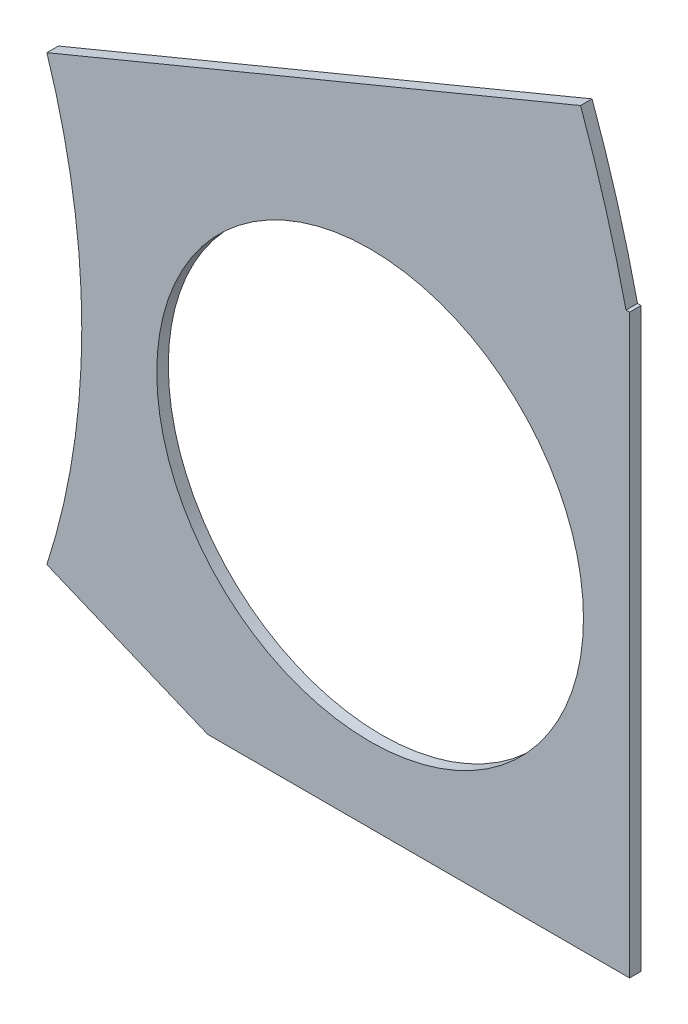
ISO-10303-21;
HEADER;
FILE_DESCRIPTION(('STEP AP214'),'2;1');
FILE_NAME('part.step','',(''),(''),'','','');
FILE_SCHEMA(('AUTOMOTIVE_DESIGN { 1 0 10303 214 1 1 1 1 }'));
ENDSEC;
DATA;
#1=APPLICATION_CONTEXT('core data for automotive mechanical design processes');
#2=APPLICATION_PROTOCOL_DEFINITION('international standard','automotive_design',2000,#1);
#3=PRODUCT_CONTEXT('',#1,'mechanical');
#4=PRODUCT('Part','Part','',(#3));
#5=PRODUCT_RELATED_PRODUCT_CATEGORY('part','',(#4));
#6=PRODUCT_DEFINITION_FORMATION('','',#4);
#7=PRODUCT_DEFINITION_CONTEXT('part definition',#1,'design');
#8=PRODUCT_DEFINITION('design','',#6,#7);
#9=PRODUCT_DEFINITION_SHAPE('','',#8);
#10=(LENGTH_UNIT() NAMED_UNIT(*) SI_UNIT(.MILLI.,.METRE.));
#11=(NAMED_UNIT(*) PLANE_ANGLE_UNIT() SI_UNIT($,.RADIAN.));
#12=(NAMED_UNIT(*) SI_UNIT($,.STERADIAN.) SOLID_ANGLE_UNIT());
#13=UNCERTAINTY_MEASURE_WITH_UNIT(LENGTH_MEASURE(1.E-05),#10,'distance_accuracy_value','');
#14=(GEOMETRIC_REPRESENTATION_CONTEXT(3) GLOBAL_UNCERTAINTY_ASSIGNED_CONTEXT((#13)) GLOBAL_UNIT_ASSIGNED_CONTEXT((#10,
#11,#12)) REPRESENTATION_CONTEXT('',''));
#15=CARTESIAN_POINT('',(0.,0.,0.));
#16=DIRECTION('',(0.,0.,1.));
#17=DIRECTION('',(1.,0.,0.));
#18=AXIS2_PLACEMENT_3D('',#15,#16,#17);
#19=CARTESIAN_POINT('',(0.,0.,0.254));
#20=DIRECTION('',(0.,0.,-1.));
#21=DIRECTION('',(-1.,0.,0.));
#22=AXIS2_PLACEMENT_3D('',#19,#20,#21);
#23=PLANE('',#22);
#24=CARTESIAN_POINT('',(22.225,0.,0.254));
#25=DIRECTION('',(0.,0.,1.));
#26=DIRECTION('',(1.,0.,0.));
#27=AXIS2_PLACEMENT_3D('',#24,#25,#26);
#28=CIRCLE('',#27,4.699);
#29=CARTESIAN_POINT('',(26.924,0.,0.254));
#30=VERTEX_POINT('',#29);
#31=EDGE_CURVE('E117',#30,#30,#28,.T.);
#32=ORIENTED_EDGE('',*,*,#31,.F.);
#33=EDGE_LOOP('',(#32));
#34=FACE_BOUND('',#33,.T.);
#35=CARTESIAN_POINT('',(0.,0.,0.254));
#36=DIRECTION('',(0.,0.,-1.));
#37=DIRECTION('',(-1.,0.,0.));
#38=AXIS2_PLACEMENT_3D('',#35,#36,#37);
#39=CIRCLE('',#38,28.575);
#40=CARTESIAN_POINT('',(26.8597787783913,9.75104655797939,0.254));
#41=VERTEX_POINT('',#40);
#42=CARTESIAN_POINT('',(27.86051192997,6.34999999999999,0.254));
#43=VERTEX_POINT('',#42);
#44=EDGE_CURVE('E108',#41,#43,#39,.T.);
#45=ORIENTED_EDGE('',*,*,#44,.F.);
#46=DIRECTION('',(0.923879532511287,0.38268343236509,0.));
#47=VECTOR('',#46,1.);
#48=CARTESIAN_POINT('',(14.5659320345757,4.65876850295464,0.254));
#49=LINE('',#48,#47);
#50=CARTESIAN_POINT('',(15.1055871232775,4.88230095969858,0.254));
#51=VERTEX_POINT('',#50);
#52=EDGE_CURVE('E128',#51,#41,#49,.T.);
#53=ORIENTED_EDGE('',*,*,#52,.F.);
#54=CARTESIAN_POINT('',(0.,0.,0.254));
#55=DIRECTION('',(0.,0.,-1.));
#56=DIRECTION('',(-1.,0.,0.));
#57=AXIS2_PLACEMENT_3D('',#54,#55,#56);
#58=CIRCLE('',#57,15.875);
#59=CARTESIAN_POINT('',(15.1055871232775,-4.88230095969859,0.254));
#60=VERTEX_POINT('',#59);
#61=EDGE_CURVE('E95',#51,#60,#58,.T.);
#62=ORIENTED_EDGE('',*,*,#61,.T.);
#63=DIRECTION('',(0.923879532511287,-0.38268343236509,0.));
#64=VECTOR('',#63,1.);
#65=CARTESIAN_POINT('',(15.1055871232775,-4.88230095969859,0.254));
#66=LINE('',#65,#64);
#67=CARTESIAN_POINT('',(18.6489260518551,-6.35000000000001,0.254));
#68=VERTEX_POINT('',#67);
#69=EDGE_CURVE('E58',#60,#68,#66,.T.);
#70=ORIENTED_EDGE('',*,*,#69,.T.);
#71=DIRECTION('',(1.,0.,0.));
#72=VECTOR('',#71,1.);
#73=CARTESIAN_POINT('',(101.401368333963,-6.35,0.254));
#74=LINE('',#73,#72);
#75=CARTESIAN_POINT('',(27.94,-6.35000000000001,0.254));
#76=VERTEX_POINT('',#75);
#77=EDGE_CURVE('E88',#68,#76,#74,.T.);
#78=ORIENTED_EDGE('',*,*,#77,.T.);
#79=DIRECTION('',(0.,-1.,0.));
#80=VECTOR('',#79,1.);
#81=CARTESIAN_POINT('',(27.94,-6.35000000000001,0.254));
#82=LINE('',#81,#80);
#83=CARTESIAN_POINT('',(27.94,6.34999999999999,0.254));
#84=VERTEX_POINT('',#83);
#85=EDGE_CURVE('E124',#84,#76,#82,.T.);
#86=ORIENTED_EDGE('',*,*,#85,.F.);
#87=DIRECTION('',(1.,0.,0.));
#88=VECTOR('',#87,1.);
#89=CARTESIAN_POINT('',(88.6729242779328,6.35,0.254));
#90=LINE('',#89,#88);
#91=EDGE_CURVE('E105',#43,#84,#90,.T.);
#92=ORIENTED_EDGE('',*,*,#91,.F.);
#93=EDGE_LOOP('',(#45,#53,#62,#70,#78,#86,#92));
#94=FACE_BOUND('',#93,.T.);
#95=ADVANCED_FACE('F35',(#34,#94),#23,.F.);
#96=CARTESIAN_POINT('',(0.,0.,0.));
#97=DIRECTION('',(0.,0.,-1.));
#98=DIRECTION('',(-1.,0.,0.));
#99=AXIS2_PLACEMENT_3D('',#96,#97,#98);
#100=PLANE('',#99);
#101=CARTESIAN_POINT('',(22.225,0.,0.));
#102=DIRECTION('',(0.,0.,1.));
#103=DIRECTION('',(1.,0.,0.));
#104=AXIS2_PLACEMENT_3D('',#101,#102,#103);
#105=CIRCLE('',#104,4.699);
#106=CARTESIAN_POINT('',(26.924,0.,0.));
#107=VERTEX_POINT('',#106);
#108=EDGE_CURVE('E112',#107,#107,#105,.T.);
#109=ORIENTED_EDGE('',*,*,#108,.T.);
#110=EDGE_LOOP('',(#109));
#111=FACE_BOUND('',#110,.T.);
#112=DIRECTION('',(0.923879532511287,0.38268343236509,0.));
#113=VECTOR('',#112,1.);
#114=CARTESIAN_POINT('',(14.5659320345757,4.65876850295464,0.));
#115=LINE('',#114,#113);
#116=CARTESIAN_POINT('',(15.1055871232775,4.88230095969858,0.));
#117=VERTEX_POINT('',#116);
#118=CARTESIAN_POINT('',(26.8597787783913,9.75104655797939,0.));
#119=VERTEX_POINT('',#118);
#120=EDGE_CURVE('E50',#117,#119,#115,.T.);
#121=ORIENTED_EDGE('',*,*,#120,.T.);
#122=CARTESIAN_POINT('',(0.,0.,0.));
#123=DIRECTION('',(0.,0.,-1.));
#124=DIRECTION('',(-1.,0.,0.));
#125=AXIS2_PLACEMENT_3D('',#122,#123,#124);
#126=CIRCLE('',#125,28.575);
#127=CARTESIAN_POINT('',(27.86051192997,6.34999999999999,0.));
#128=VERTEX_POINT('',#127);
#129=EDGE_CURVE('E109',#119,#128,#126,.T.);
#130=ORIENTED_EDGE('',*,*,#129,.T.);
#131=DIRECTION('',(1.,0.,0.));
#132=VECTOR('',#131,1.);
#133=CARTESIAN_POINT('',(88.6729242779328,6.35,0.));
#134=LINE('',#133,#132);
#135=CARTESIAN_POINT('',(27.94,6.34999999999999,0.));
#136=VERTEX_POINT('',#135);
#137=EDGE_CURVE('E106',#128,#136,#134,.T.);
#138=ORIENTED_EDGE('',*,*,#137,.T.);
#139=DIRECTION('',(0.,-1.,0.));
#140=VECTOR('',#139,1.);
#141=CARTESIAN_POINT('',(27.94,-6.35000000000001,0.));
#142=LINE('',#141,#140);
#143=CARTESIAN_POINT('',(27.94,-6.35000000000001,0.));
#144=VERTEX_POINT('',#143);
#145=EDGE_CURVE('E94',#136,#144,#142,.T.);
#146=ORIENTED_EDGE('',*,*,#145,.T.);
#147=DIRECTION('',(1.,0.,0.));
#148=VECTOR('',#147,1.);
#149=CARTESIAN_POINT('',(101.401368333963,-6.35,0.));
#150=LINE('',#149,#148);
#151=CARTESIAN_POINT('',(18.6489260518551,-6.35000000000001,0.));
#152=VERTEX_POINT('',#151);
#153=EDGE_CURVE('E80',#152,#144,#150,.T.);
#154=ORIENTED_EDGE('',*,*,#153,.F.);
#155=DIRECTION('',(0.923879532511287,-0.38268343236509,0.));
#156=VECTOR('',#155,1.);
#157=CARTESIAN_POINT('',(15.1055871232775,-4.88230095969859,0.));
#158=LINE('',#157,#156);
#159=CARTESIAN_POINT('',(15.1055871232775,-4.88230095969859,0.));
#160=VERTEX_POINT('',#159);
#161=EDGE_CURVE('E71',#160,#152,#158,.T.);
#162=ORIENTED_EDGE('',*,*,#161,.F.);
#163=CARTESIAN_POINT('',(0.,0.,0.));
#164=DIRECTION('',(0.,0.,-1.));
#165=DIRECTION('',(-1.,0.,0.));
#166=AXIS2_PLACEMENT_3D('',#163,#164,#165);
#167=CIRCLE('',#166,15.875);
#168=EDGE_CURVE('E81',#117,#160,#167,.T.);
#169=ORIENTED_EDGE('',*,*,#168,.F.);
#170=EDGE_LOOP('',(#121,#130,#138,#146,#154,#162,#169));
#171=FACE_BOUND('',#170,.T.);
#172=ADVANCED_FACE('F91',(#111,#171),#100,.T.);
#173=CARTESIAN_POINT('',(0.,0.,0.254));
#174=DIRECTION('',(0.,0.,-1.));
#175=DIRECTION('',(-1.,0.,0.));
#176=AXIS2_PLACEMENT_3D('',#173,#174,#175);
#177=CYLINDRICAL_SURFACE('',#176,28.575);
#178=ORIENTED_EDGE('',*,*,#129,.F.);
#179=DIRECTION('',(0.,0.,-1.));
#180=VECTOR('',#179,1.);
#181=CARTESIAN_POINT('',(26.8597787783913,9.75104655797939,0.254));
#182=LINE('',#181,#180);
#183=EDGE_CURVE('E135',#119,#41,#182,.F.);
#184=ORIENTED_EDGE('',*,*,#183,.T.);
#185=ORIENTED_EDGE('',*,*,#44,.T.);
#186=DIRECTION('',(0.,0.,-1.));
#187=VECTOR('',#186,1.);
#188=CARTESIAN_POINT('',(27.86051192997,6.34999999999999,0.254));
#189=LINE('',#188,#187);
#190=EDGE_CURVE('E100',#43,#128,#189,.T.);
#191=ORIENTED_EDGE('',*,*,#190,.T.);
#192=EDGE_LOOP('',(#178,#184,#185,#191));
#193=FACE_BOUND('',#192,.T.);
#194=ADVANCED_FACE('F141',(#193),#177,.T.);
#195=CARTESIAN_POINT('',(88.6729242779328,6.35,0.254));
#196=DIRECTION('',(0.,1.,0.));
#197=DIRECTION('',(-1.,0.,0.));
#198=AXIS2_PLACEMENT_3D('',#195,#196,#197);
#199=PLANE('',#198);
#200=ORIENTED_EDGE('',*,*,#91,.T.);
#201=DIRECTION('',(0.,0.,-1.));
#202=VECTOR('',#201,1.);
#203=CARTESIAN_POINT('',(27.94,6.34999999999999,0.254));
#204=LINE('',#203,#202);
#205=EDGE_CURVE('E131',#84,#136,#204,.T.);
#206=ORIENTED_EDGE('',*,*,#205,.T.);
#207=ORIENTED_EDGE('',*,*,#137,.F.);
#208=ORIENTED_EDGE('',*,*,#190,.F.);
#209=EDGE_LOOP('',(#200,#206,#207,#208));
#210=FACE_BOUND('',#209,.T.);
#211=ADVANCED_FACE('F155',(#210),#199,.T.);
#212=CARTESIAN_POINT('',(101.401368333963,-6.35,0.254));
#213=DIRECTION('',(0.,1.,0.));
#214=DIRECTION('',(-1.,0.,0.));
#215=AXIS2_PLACEMENT_3D('',#212,#213,#214);
#216=PLANE('',#215);
#217=ORIENTED_EDGE('',*,*,#153,.T.);
#218=DIRECTION('',(0.,0.,1.));
#219=VECTOR('',#218,1.);
#220=CARTESIAN_POINT('',(27.94,-6.35000000000001,0.));
#221=LINE('',#220,#219);
#222=EDGE_CURVE('E120',#144,#76,#221,.T.);
#223=ORIENTED_EDGE('',*,*,#222,.T.);
#224=ORIENTED_EDGE('',*,*,#77,.F.);
#225=DIRECTION('',(0.,0.,-1.));
#226=VECTOR('',#225,1.);
#227=CARTESIAN_POINT('',(18.6489260518551,-6.35000000000001,0.254));
#228=LINE('',#227,#226);
#229=EDGE_CURVE('E74',#68,#152,#228,.T.);
#230=ORIENTED_EDGE('',*,*,#229,.T.);
#231=EDGE_LOOP('',(#217,#223,#224,#230));
#232=FACE_BOUND('',#231,.T.);
#233=ADVANCED_FACE('F85',(#232),#216,.F.);
#234=CARTESIAN_POINT('',(0.,0.,0.254));
#235=DIRECTION('',(0.,0.,-1.));
#236=DIRECTION('',(-1.,0.,0.));
#237=AXIS2_PLACEMENT_3D('',#234,#235,#236);
#238=CYLINDRICAL_SURFACE('',#237,15.875);
#239=ORIENTED_EDGE('',*,*,#61,.F.);
#240=DIRECTION('',(0.,0.,-1.));
#241=VECTOR('',#240,1.);
#242=CARTESIAN_POINT('',(15.1055871232775,4.88230095969859,0.254));
#243=LINE('',#242,#241);
#244=EDGE_CURVE('E12',#51,#117,#243,.T.);
#245=ORIENTED_EDGE('',*,*,#244,.T.);
#246=ORIENTED_EDGE('',*,*,#168,.T.);
#247=DIRECTION('',(0.,0.,-1.));
#248=VECTOR('',#247,1.);
#249=CARTESIAN_POINT('',(15.1055871232775,-4.88230095969859,0.254));
#250=LINE('',#249,#248);
#251=EDGE_CURVE('E43',#60,#160,#250,.T.);
#252=ORIENTED_EDGE('',*,*,#251,.F.);
#253=EDGE_LOOP('',(#239,#245,#246,#252));
#254=FACE_BOUND('',#253,.T.);
#255=ADVANCED_FACE('F37',(#254),#238,.F.);
#256=CARTESIAN_POINT('',(15.1055871232775,-4.88230095969859,0.254));
#257=DIRECTION('',(0.38268343236509,0.923879532511287,0.));
#258=DIRECTION('',(-0.923879532511287,0.38268343236509,0.));
#259=AXIS2_PLACEMENT_3D('',#256,#257,#258);
#260=PLANE('',#259);
#261=ORIENTED_EDGE('',*,*,#161,.T.);
#262=ORIENTED_EDGE('',*,*,#229,.F.);
#263=ORIENTED_EDGE('',*,*,#69,.F.);
#264=ORIENTED_EDGE('',*,*,#251,.T.);
#265=EDGE_LOOP('',(#261,#262,#263,#264));
#266=FACE_BOUND('',#265,.T.);
#267=ADVANCED_FACE('F73',(#266),#260,.F.);
#268=CARTESIAN_POINT('',(22.225,0.,0.));
#269=DIRECTION('',(0.,0.,1.));
#270=DIRECTION('',(1.,0.,0.));
#271=AXIS2_PLACEMENT_3D('',#268,#269,#270);
#272=CYLINDRICAL_SURFACE('',#271,4.699);
#273=ORIENTED_EDGE('',*,*,#108,.F.);
#274=EDGE_LOOP('',(#273));
#275=FACE_BOUND('',#274,.T.);
#276=ORIENTED_EDGE('',*,*,#31,.T.);
#277=EDGE_LOOP('',(#276));
#278=FACE_BOUND('',#277,.T.);
#279=ADVANCED_FACE('F174',(#275,#278),#272,.F.);
#280=CARTESIAN_POINT('',(27.94,-6.35000000000001,0.));
#281=DIRECTION('',(-1.,0.,0.));
#282=DIRECTION('',(0.,0.,1.));
#283=AXIS2_PLACEMENT_3D('',#280,#281,#282);
#284=PLANE('',#283);
#285=ORIENTED_EDGE('',*,*,#85,.T.);
#286=ORIENTED_EDGE('',*,*,#222,.F.);
#287=ORIENTED_EDGE('',*,*,#145,.F.);
#288=ORIENTED_EDGE('',*,*,#205,.F.);
#289=EDGE_LOOP('',(#285,#286,#287,#288));
#290=FACE_BOUND('',#289,.T.);
#291=ADVANCED_FACE('F169',(#290),#284,.F.);
#292=CARTESIAN_POINT('',(14.5659320345757,4.65876850295464,0.));
#293=DIRECTION('',(0.38268343236509,-0.923879532511287,0.));
#294=DIRECTION('',(0.923879532511287,0.38268343236509,0.));
#295=AXIS2_PLACEMENT_3D('',#292,#293,#294);
#296=PLANE('',#295);
#297=ORIENTED_EDGE('',*,*,#52,.T.);
#298=ORIENTED_EDGE('',*,*,#183,.F.);
#299=ORIENTED_EDGE('',*,*,#120,.F.);
#300=ORIENTED_EDGE('',*,*,#244,.F.);
#301=EDGE_LOOP('',(#297,#298,#299,#300));
#302=FACE_BOUND('',#301,.T.);
#303=ADVANCED_FACE('F167',(#302),#296,.F.);
#304=CLOSED_SHELL('',(#95,#172,#194,#211,#233,#255,#267,#279,#291,#303));
#305=MANIFOLD_SOLID_BREP('B2',#304);
#306=ADVANCED_BREP_SHAPE_REPRESENTATION('',(#18,#305),#14);
#307=SHAPE_DEFINITION_REPRESENTATION(#9,#306);
ENDSEC;
END-ISO-10303-21;
